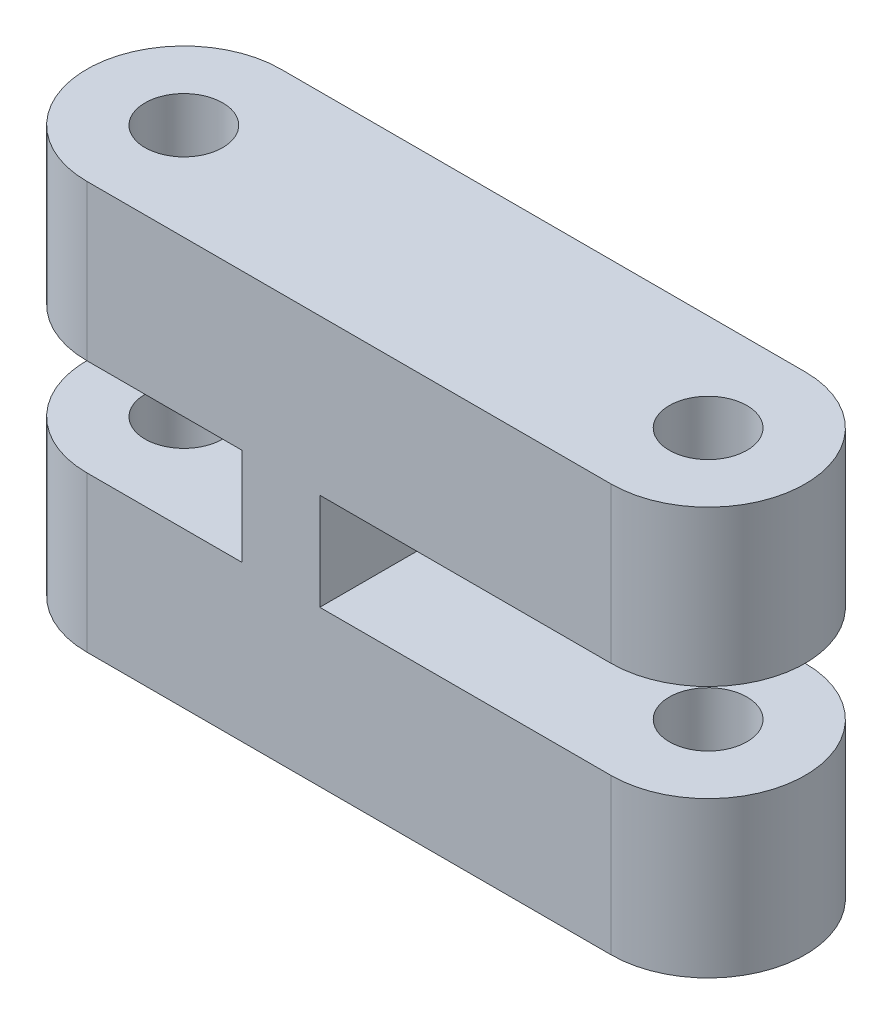
ISO-10303-21;
HEADER;
FILE_DESCRIPTION(('STEP AP214'),'2;1');
FILE_NAME('part.step','',(''),(''),'','','');
FILE_SCHEMA(('AUTOMOTIVE_DESIGN { 1 0 10303 214 1 1 1 1 }'));
ENDSEC;
DATA;
#1=APPLICATION_CONTEXT('core data for automotive mechanical design processes');
#2=APPLICATION_PROTOCOL_DEFINITION('international standard','automotive_design',2000,#1);
#3=PRODUCT_CONTEXT('',#1,'mechanical');
#4=PRODUCT('Part','Part','',(#3));
#5=PRODUCT_RELATED_PRODUCT_CATEGORY('part','',(#4));
#6=PRODUCT_DEFINITION_FORMATION('','',#4);
#7=PRODUCT_DEFINITION_CONTEXT('part definition',#1,'design');
#8=PRODUCT_DEFINITION('design','',#6,#7);
#9=PRODUCT_DEFINITION_SHAPE('','',#8);
#10=(LENGTH_UNIT() NAMED_UNIT(*) SI_UNIT(.MILLI.,.METRE.));
#11=(NAMED_UNIT(*) PLANE_ANGLE_UNIT() SI_UNIT($,.RADIAN.));
#12=(NAMED_UNIT(*) SI_UNIT($,.STERADIAN.) SOLID_ANGLE_UNIT());
#13=UNCERTAINTY_MEASURE_WITH_UNIT(LENGTH_MEASURE(1.E-05),#10,'distance_accuracy_value','');
#14=(GEOMETRIC_REPRESENTATION_CONTEXT(3) GLOBAL_UNCERTAINTY_ASSIGNED_CONTEXT((#13)) GLOBAL_UNIT_ASSIGNED_CONTEXT((#10,
#11,#12)) REPRESENTATION_CONTEXT('',''));
#15=CARTESIAN_POINT('',(0.,0.,0.));
#16=DIRECTION('',(0.,0.,1.));
#17=DIRECTION('',(1.,0.,0.));
#18=AXIS2_PLACEMENT_3D('',#15,#16,#17);
#19=CARTESIAN_POINT('',(-8.87448138205192,21.,32.1786968159599));
#20=DIRECTION('',(0.,0.,-1.));
#21=DIRECTION('',(-1.,0.,0.));
#22=AXIS2_PLACEMENT_3D('',#19,#20,#21);
#23=PLANE('',#22);
#24=DIRECTION('',(0.,-1.,0.));
#25=VECTOR('',#24,1.);
#26=CARTESIAN_POINT('',(-8.87448138205192,21.,32.1786968159599));
#27=LINE('',#26,#25);
#28=CARTESIAN_POINT('',(-8.87448138205192,8.,32.1786968159599));
#29=VERTEX_POINT('',#28);
#30=CARTESIAN_POINT('',(-8.87448138205192,0.,32.1786968159599));
#31=VERTEX_POINT('',#30);
#32=EDGE_CURVE('E22',#29,#31,#27,.T.);
#33=ORIENTED_EDGE('',*,*,#32,.F.);
#34=DIRECTION('',(1.,0.,0.));
#35=VECTOR('',#34,1.);
#36=CARTESIAN_POINT('',(-8.87448138205192,8.,32.1786968159599));
#37=LINE('',#36,#35);
#38=CARTESIAN_POINT('',(-0.874481382051926,8.,32.1786968159599));
#39=VERTEX_POINT('',#38);
#40=EDGE_CURVE('E141',#29,#39,#37,.T.);
#41=ORIENTED_EDGE('',*,*,#40,.T.);
#42=DIRECTION('',(0.,1.,0.));
#43=VECTOR('',#42,1.);
#44=CARTESIAN_POINT('',(-0.874481382051928,21.,32.1786968159599));
#45=LINE('',#44,#43);
#46=CARTESIAN_POINT('',(-0.874481382051926,13.,32.1786968159599));
#47=VERTEX_POINT('',#46);
#48=EDGE_CURVE('E144',#39,#47,#45,.T.);
#49=ORIENTED_EDGE('',*,*,#48,.T.);
#50=DIRECTION('',(-1.,0.,0.));
#51=VECTOR('',#50,1.);
#52=CARTESIAN_POINT('',(-8.87448138205192,13.,32.1786968159599));
#53=LINE('',#52,#51);
#54=CARTESIAN_POINT('',(-8.87448138205192,13.,32.1786968159599));
#55=VERTEX_POINT('',#54);
#56=EDGE_CURVE('E110',#47,#55,#53,.T.);
#57=ORIENTED_EDGE('',*,*,#56,.T.);
#58=CARTESIAN_POINT('',(-8.87448138205192,21.,32.1786968159599));
#59=VERTEX_POINT('',#58);
#60=EDGE_CURVE('E9',#59,#55,#27,.T.);
#61=ORIENTED_EDGE('',*,*,#60,.F.);
#62=DIRECTION('',(1.,0.,0.));
#63=VECTOR('',#62,1.);
#64=CARTESIAN_POINT('',(-8.87448138205192,21.,32.1786968159599));
#65=LINE('',#64,#63);
#66=CARTESIAN_POINT('',(18.1255186179481,21.,32.1786968159599));
#67=VERTEX_POINT('',#66);
#68=EDGE_CURVE('E193',#59,#67,#65,.T.);
#69=ORIENTED_EDGE('',*,*,#68,.T.);
#70=DIRECTION('',(0.,-1.,0.));
#71=VECTOR('',#70,1.);
#72=CARTESIAN_POINT('',(18.1255186179481,21.,32.1786968159599));
#73=LINE('',#72,#71);
#74=CARTESIAN_POINT('',(18.1255186179481,13.,32.1786968159599));
#75=VERTEX_POINT('',#74);
#76=EDGE_CURVE('E223',#67,#75,#73,.T.);
#77=ORIENTED_EDGE('',*,*,#76,.T.);
#78=DIRECTION('',(1.,0.,0.));
#79=VECTOR('',#78,1.);
#80=CARTESIAN_POINT('',(-8.87448138205192,13.,32.1786968159599));
#81=LINE('',#80,#79);
#82=CARTESIAN_POINT('',(3.12551861794808,13.,32.1786968159599));
#83=VERTEX_POINT('',#82);
#84=EDGE_CURVE('E168',#83,#75,#81,.T.);
#85=ORIENTED_EDGE('',*,*,#84,.F.);
#86=DIRECTION('',(0.,1.,0.));
#87=VECTOR('',#86,1.);
#88=CARTESIAN_POINT('',(3.12551861794808,21.,32.1786968159599));
#89=LINE('',#88,#87);
#90=CARTESIAN_POINT('',(3.12551861794808,8.,32.1786968159599));
#91=VERTEX_POINT('',#90);
#92=EDGE_CURVE('E174',#91,#83,#89,.T.);
#93=ORIENTED_EDGE('',*,*,#92,.F.);
#94=DIRECTION('',(-1.,0.,0.));
#95=VECTOR('',#94,1.);
#96=CARTESIAN_POINT('',(-8.87448138205192,8.,32.1786968159599));
#97=LINE('',#96,#95);
#98=CARTESIAN_POINT('',(18.1255186179481,8.,32.1786968159599));
#99=VERTEX_POINT('',#98);
#100=EDGE_CURVE('E172',#99,#91,#97,.T.);
#101=ORIENTED_EDGE('',*,*,#100,.F.);
#102=CARTESIAN_POINT('',(18.1255186179481,0.,32.1786968159599));
#103=VERTEX_POINT('',#102);
#104=EDGE_CURVE('E222',#99,#103,#73,.T.);
#105=ORIENTED_EDGE('',*,*,#104,.T.);
#106=DIRECTION('',(1.,0.,0.));
#107=VECTOR('',#106,1.);
#108=CARTESIAN_POINT('',(-8.87448138205192,0.,32.1786968159599));
#109=LINE('',#108,#107);
#110=EDGE_CURVE('E192',#31,#103,#109,.T.);
#111=ORIENTED_EDGE('',*,*,#110,.F.);
#112=EDGE_LOOP('',(#33,#41,#49,#57,#61,#69,#77,#85,#93,#101,#105,#111));
#113=FACE_BOUND('',#112,.T.);
#114=ADVANCED_FACE('F15',(#113),#23,.T.);
#115=CARTESIAN_POINT('',(18.1255186179481,21.,42.1786968159599));
#116=DIRECTION('',(0.,0.,1.));
#117=DIRECTION('',(1.,0.,0.));
#118=AXIS2_PLACEMENT_3D('',#115,#116,#117);
#119=PLANE('',#118);
#120=DIRECTION('',(0.,-1.,0.));
#121=VECTOR('',#120,1.);
#122=CARTESIAN_POINT('',(-0.874481382051926,13.,42.1786968159599));
#123=LINE('',#122,#121);
#124=CARTESIAN_POINT('',(-0.874481382051926,13.,42.1786968159599));
#125=VERTEX_POINT('',#124);
#126=CARTESIAN_POINT('',(-0.874481382051926,8.,42.1786968159599));
#127=VERTEX_POINT('',#126);
#128=EDGE_CURVE('E116',#125,#127,#123,.T.);
#129=ORIENTED_EDGE('',*,*,#128,.T.);
#130=DIRECTION('',(-1.,0.,0.));
#131=VECTOR('',#130,1.);
#132=CARTESIAN_POINT('',(-0.874481382051926,8.,42.1786968159599));
#133=LINE('',#132,#131);
#134=CARTESIAN_POINT('',(-8.87448138205193,8.,42.1786968159599));
#135=VERTEX_POINT('',#134);
#136=EDGE_CURVE('E126',#127,#135,#133,.T.);
#137=ORIENTED_EDGE('',*,*,#136,.T.);
#138=DIRECTION('',(0.,-1.,0.));
#139=VECTOR('',#138,1.);
#140=CARTESIAN_POINT('',(-8.87448138205192,21.,42.1786968159599));
#141=LINE('',#140,#139);
#142=CARTESIAN_POINT('',(-8.87448138205192,0.,42.1786968159599));
#143=VERTEX_POINT('',#142);
#144=EDGE_CURVE('E203',#135,#143,#141,.T.);
#145=ORIENTED_EDGE('',*,*,#144,.T.);
#146=DIRECTION('',(-1.,0.,0.));
#147=VECTOR('',#146,1.);
#148=CARTESIAN_POINT('',(18.1255186179481,0.,42.1786968159599));
#149=LINE('',#148,#147);
#150=CARTESIAN_POINT('',(18.1255186179481,0.,42.1786968159599));
#151=VERTEX_POINT('',#150);
#152=EDGE_CURVE('E211',#151,#143,#149,.T.);
#153=ORIENTED_EDGE('',*,*,#152,.F.);
#154=DIRECTION('',(0.,-1.,0.));
#155=VECTOR('',#154,1.);
#156=CARTESIAN_POINT('',(18.1255186179481,21.,42.1786968159599));
#157=LINE('',#156,#155);
#158=CARTESIAN_POINT('',(18.1255186179481,8.,42.1786968159599));
#159=VERTEX_POINT('',#158);
#160=EDGE_CURVE('E219',#159,#151,#157,.T.);
#161=ORIENTED_EDGE('',*,*,#160,.F.);
#162=DIRECTION('',(1.,0.,0.));
#163=VECTOR('',#162,1.);
#164=CARTESIAN_POINT('',(3.12551861794808,8.,42.1786968159599));
#165=LINE('',#164,#163);
#166=CARTESIAN_POINT('',(3.12551861794808,8.,42.1786968159599));
#167=VERTEX_POINT('',#166);
#168=EDGE_CURVE('E146',#167,#159,#165,.T.);
#169=ORIENTED_EDGE('',*,*,#168,.F.);
#170=DIRECTION('',(0.,-1.,0.));
#171=VECTOR('',#170,1.);
#172=CARTESIAN_POINT('',(3.12551861794808,13.,42.1786968159599));
#173=LINE('',#172,#171);
#174=CARTESIAN_POINT('',(3.12551861794808,13.,42.1786968159599));
#175=VERTEX_POINT('',#174);
#176=EDGE_CURVE('E155',#175,#167,#173,.T.);
#177=ORIENTED_EDGE('',*,*,#176,.F.);
#178=DIRECTION('',(-1.,0.,0.));
#179=VECTOR('',#178,1.);
#180=CARTESIAN_POINT('',(23.1255186179481,13.,42.1786968159599));
#181=LINE('',#180,#179);
#182=CARTESIAN_POINT('',(18.1255186179481,13.,42.1786968159599));
#183=VERTEX_POINT('',#182);
#184=EDGE_CURVE('E151',#183,#175,#181,.T.);
#185=ORIENTED_EDGE('',*,*,#184,.F.);
#186=CARTESIAN_POINT('',(18.1255186179481,21.,42.1786968159599));
#187=VERTEX_POINT('',#186);
#188=EDGE_CURVE('E220',#187,#183,#157,.T.);
#189=ORIENTED_EDGE('',*,*,#188,.F.);
#190=DIRECTION('',(-1.,0.,0.));
#191=VECTOR('',#190,1.);
#192=CARTESIAN_POINT('',(18.1255186179481,21.,42.1786968159599));
#193=LINE('',#192,#191);
#194=CARTESIAN_POINT('',(-8.87448138205192,21.,42.1786968159599));
#195=VERTEX_POINT('',#194);
#196=EDGE_CURVE('E199',#187,#195,#193,.T.);
#197=ORIENTED_EDGE('',*,*,#196,.T.);
#198=CARTESIAN_POINT('',(-8.87448138205193,13.,42.1786968159599));
#199=VERTEX_POINT('',#198);
#200=EDGE_CURVE('E124',#195,#199,#141,.T.);
#201=ORIENTED_EDGE('',*,*,#200,.T.);
#202=DIRECTION('',(1.,0.,0.));
#203=VECTOR('',#202,1.);
#204=CARTESIAN_POINT('',(-13.8744813820519,13.,42.1786968159599));
#205=LINE('',#204,#203);
#206=EDGE_CURVE('E107',#199,#125,#205,.T.);
#207=ORIENTED_EDGE('',*,*,#206,.T.);
#208=EDGE_LOOP('',(#129,#137,#145,#153,#161,#169,#177,#185,#189,#197,#201,#207));
#209=FACE_BOUND('',#208,.T.);
#210=ADVANCED_FACE('F122',(#209),#119,.T.);
#211=CARTESIAN_POINT('',(-8.87448138205193,21.,37.1786968159599));
#212=DIRECTION('',(0.,-1.,0.));
#213=DIRECTION('',(0.,0.,-1.));
#214=AXIS2_PLACEMENT_3D('',#211,#212,#213);
#215=CYLINDRICAL_SURFACE('',#214,5.);
#216=ORIENTED_EDGE('',*,*,#144,.F.);
#217=CARTESIAN_POINT('',(-8.87448138205193,8.,37.1786968159599));
#218=DIRECTION('',(0.,1.,0.));
#219=DIRECTION('',(0.,0.,1.));
#220=AXIS2_PLACEMENT_3D('',#217,#218,#219);
#221=CIRCLE('',#220,5.);
#222=EDGE_CURVE('E138',#135,#29,#221,.F.);
#223=ORIENTED_EDGE('',*,*,#222,.T.);
#224=ORIENTED_EDGE('',*,*,#32,.T.);
#225=CARTESIAN_POINT('',(-8.87448138205193,0.,37.1786968159599));
#226=DIRECTION('',(0.,-1.,0.));
#227=DIRECTION('',(1.,0.,0.));
#228=AXIS2_PLACEMENT_3D('',#225,#226,#227);
#229=CIRCLE('',#228,5.);
#230=EDGE_CURVE('E197',#143,#31,#229,.T.);
#231=ORIENTED_EDGE('',*,*,#230,.F.);
#232=EDGE_LOOP('',(#216,#223,#224,#231));
#233=FACE_BOUND('',#232,.T.);
#234=ADVANCED_FACE('F241',(#233),#215,.T.);
#235=CARTESIAN_POINT('',(-8.87448138205193,13.,37.1786968159599));
#236=DIRECTION('',(0.,-1.,0.));
#237=DIRECTION('',(1.,0.,0.));
#238=AXIS2_PLACEMENT_3D('',#235,#236,#237);
#239=CIRCLE('',#238,5.);
#240=EDGE_CURVE('E134',#55,#199,#239,.F.);
#241=ORIENTED_EDGE('',*,*,#240,.T.);
#242=ORIENTED_EDGE('',*,*,#200,.F.);
#243=CARTESIAN_POINT('',(-8.87448138205193,21.,37.1786968159599));
#244=DIRECTION('',(0.,-1.,0.));
#245=DIRECTION('',(1.,0.,0.));
#246=AXIS2_PLACEMENT_3D('',#243,#244,#245);
#247=CIRCLE('',#246,5.);
#248=EDGE_CURVE('E201',#195,#59,#247,.T.);
#249=ORIENTED_EDGE('',*,*,#248,.T.);
#250=ORIENTED_EDGE('',*,*,#60,.T.);
#251=EDGE_LOOP('',(#241,#242,#249,#250));
#252=FACE_BOUND('',#251,.T.);
#253=ADVANCED_FACE('F265',(#252),#215,.T.);
#254=CARTESIAN_POINT('',(-8.87448138205193,0.,37.1786968159599));
#255=DIRECTION('',(0.,1.,0.));
#256=DIRECTION('',(0.,0.,-1.));
#257=AXIS2_PLACEMENT_3D('',#254,#255,#256);
#258=CYLINDRICAL_SURFACE('',#257,2.);
#259=CARTESIAN_POINT('',(-8.87448138205193,0.,37.1786968159599));
#260=DIRECTION('',(0.,1.,0.));
#261=DIRECTION('',(0.,0.,-1.));
#262=AXIS2_PLACEMENT_3D('',#259,#260,#261);
#263=CIRCLE('',#262,2.);
#264=CARTESIAN_POINT('',(-8.87448138205193,0.,35.1786968159599));
#265=VERTEX_POINT('',#264);
#266=EDGE_CURVE('E186',#265,#265,#263,.T.);
#267=ORIENTED_EDGE('',*,*,#266,.F.);
#268=EDGE_LOOP('',(#267));
#269=FACE_BOUND('',#268,.T.);
#270=CARTESIAN_POINT('',(-8.87448138205193,8.,37.1786968159599));
#271=DIRECTION('',(0.,1.,0.));
#272=DIRECTION('',(0.,0.,1.));
#273=AXIS2_PLACEMENT_3D('',#270,#271,#272);
#274=CIRCLE('',#273,2.);
#275=CARTESIAN_POINT('',(-8.87448138205193,8.,39.1786968159599));
#276=VERTEX_POINT('',#275);
#277=EDGE_CURVE('E137',#276,#276,#274,.F.);
#278=ORIENTED_EDGE('',*,*,#277,.F.);
#279=EDGE_LOOP('',(#278));
#280=FACE_BOUND('',#279,.T.);
#281=ADVANCED_FACE('F267',(#269,#280),#258,.F.);
#282=CARTESIAN_POINT('',(-8.87448138205193,21.,37.1786968159599));
#283=DIRECTION('',(0.,-1.,0.));
#284=DIRECTION('',(0.,0.,-1.));
#285=AXIS2_PLACEMENT_3D('',#282,#283,#284);
#286=CIRCLE('',#285,2.);
#287=CARTESIAN_POINT('',(-8.87448138205193,21.,35.1786968159599));
#288=VERTEX_POINT('',#287);
#289=EDGE_CURVE('E189',#288,#288,#286,.T.);
#290=ORIENTED_EDGE('',*,*,#289,.F.);
#291=EDGE_LOOP('',(#290));
#292=FACE_BOUND('',#291,.T.);
#293=CARTESIAN_POINT('',(-8.87448138205193,13.,37.1786968159599));
#294=DIRECTION('',(0.,-1.,0.));
#295=DIRECTION('',(1.,0.,0.));
#296=AXIS2_PLACEMENT_3D('',#293,#294,#295);
#297=CIRCLE('',#296,2.);
#298=CARTESIAN_POINT('',(-6.87448138205192,13.,37.1786968159599));
#299=VERTEX_POINT('',#298);
#300=EDGE_CURVE('E113',#299,#299,#297,.F.);
#301=ORIENTED_EDGE('',*,*,#300,.F.);
#302=EDGE_LOOP('',(#301));
#303=FACE_BOUND('',#302,.T.);
#304=ADVANCED_FACE('F274',(#292,#303),#258,.F.);
#305=CARTESIAN_POINT('',(18.1255186179481,21.,37.1786968159599));
#306=DIRECTION('',(0.,-1.,0.));
#307=DIRECTION('',(0.,0.,-1.));
#308=AXIS2_PLACEMENT_3D('',#305,#306,#307);
#309=CYLINDRICAL_SURFACE('',#308,5.);
#310=CARTESIAN_POINT('',(18.1255186179481,8.,37.1786968159599));
#311=DIRECTION('',(0.,-1.,0.));
#312=DIRECTION('',(1.,0.,0.));
#313=AXIS2_PLACEMENT_3D('',#310,#311,#312);
#314=CIRCLE('',#313,5.);
#315=EDGE_CURVE('E37',#159,#99,#314,.F.);
#316=ORIENTED_EDGE('',*,*,#315,.F.);
#317=ORIENTED_EDGE('',*,*,#160,.T.);
#318=CARTESIAN_POINT('',(18.1255186179481,0.,37.1786968159599));
#319=DIRECTION('',(0.,-1.,0.));
#320=DIRECTION('',(-1.,0.,0.));
#321=AXIS2_PLACEMENT_3D('',#318,#319,#320);
#322=CIRCLE('',#321,5.);
#323=EDGE_CURVE('E207',#103,#151,#322,.T.);
#324=ORIENTED_EDGE('',*,*,#323,.F.);
#325=ORIENTED_EDGE('',*,*,#104,.F.);
#326=EDGE_LOOP('',(#316,#317,#324,#325));
#327=FACE_BOUND('',#326,.T.);
#328=ADVANCED_FACE('F233',(#327),#309,.T.);
#329=CARTESIAN_POINT('',(18.1255186179481,0.,37.1786968159599));
#330=DIRECTION('',(0.,1.,0.));
#331=DIRECTION('',(0.,0.,-1.));
#332=AXIS2_PLACEMENT_3D('',#329,#330,#331);
#333=CYLINDRICAL_SURFACE('',#332,2.);
#334=CARTESIAN_POINT('',(18.1255186179481,8.,37.1786968159599));
#335=DIRECTION('',(0.,-1.,0.));
#336=DIRECTION('',(1.,0.,0.));
#337=AXIS2_PLACEMENT_3D('',#334,#335,#336);
#338=CIRCLE('',#337,2.);
#339=CARTESIAN_POINT('',(20.1255186179481,8.,37.1786968159599));
#340=VERTEX_POINT('',#339);
#341=EDGE_CURVE('E170',#340,#340,#338,.F.);
#342=ORIENTED_EDGE('',*,*,#341,.T.);
#343=EDGE_LOOP('',(#342));
#344=FACE_BOUND('',#343,.T.);
#345=CARTESIAN_POINT('',(18.1255186179481,0.,37.1786968159599));
#346=DIRECTION('',(0.,1.,0.));
#347=DIRECTION('',(0.,0.,-1.));
#348=AXIS2_PLACEMENT_3D('',#345,#346,#347);
#349=CIRCLE('',#348,2.);
#350=CARTESIAN_POINT('',(18.1255186179481,0.,35.1786968159599));
#351=VERTEX_POINT('',#350);
#352=EDGE_CURVE('E176',#351,#351,#349,.T.);
#353=ORIENTED_EDGE('',*,*,#352,.F.);
#354=EDGE_LOOP('',(#353));
#355=FACE_BOUND('',#354,.T.);
#356=ADVANCED_FACE('F286',(#344,#355),#333,.F.);
#357=CARTESIAN_POINT('',(18.1255186179481,13.,37.1786968159599));
#358=DIRECTION('',(0.,1.,0.));
#359=DIRECTION('',(0.,0.,1.));
#360=AXIS2_PLACEMENT_3D('',#357,#358,#359);
#361=CIRCLE('',#360,5.);
#362=EDGE_CURVE('E166',#75,#183,#361,.F.);
#363=ORIENTED_EDGE('',*,*,#362,.F.);
#364=ORIENTED_EDGE('',*,*,#76,.F.);
#365=CARTESIAN_POINT('',(18.1255186179481,21.,37.1786968159599));
#366=DIRECTION('',(0.,-1.,0.));
#367=DIRECTION('',(-1.,0.,0.));
#368=AXIS2_PLACEMENT_3D('',#365,#366,#367);
#369=CIRCLE('',#368,5.);
#370=EDGE_CURVE('E196',#67,#187,#369,.T.);
#371=ORIENTED_EDGE('',*,*,#370,.T.);
#372=ORIENTED_EDGE('',*,*,#188,.T.);
#373=EDGE_LOOP('',(#363,#364,#371,#372));
#374=FACE_BOUND('',#373,.T.);
#375=ADVANCED_FACE('F257',(#374),#309,.T.);
#376=CARTESIAN_POINT('',(-8.87448138205192,21.,37.1786968159599));
#377=DIRECTION('',(0.,-1.,0.));
#378=DIRECTION('',(0.,0.,-1.));
#379=AXIS2_PLACEMENT_3D('',#376,#377,#378);
#380=PLANE('',#379);
#381=CARTESIAN_POINT('',(18.1255186179481,21.,37.1786968159599));
#382=DIRECTION('',(0.,-1.,0.));
#383=DIRECTION('',(0.,0.,-1.));
#384=AXIS2_PLACEMENT_3D('',#381,#382,#383);
#385=CIRCLE('',#384,2.);
#386=CARTESIAN_POINT('',(18.1255186179481,21.,35.1786968159599));
#387=VERTEX_POINT('',#386);
#388=EDGE_CURVE('E183',#387,#387,#385,.T.);
#389=ORIENTED_EDGE('',*,*,#388,.T.);
#390=EDGE_LOOP('',(#389));
#391=FACE_BOUND('',#390,.T.);
#392=ORIENTED_EDGE('',*,*,#289,.T.);
#393=EDGE_LOOP('',(#392));
#394=FACE_BOUND('',#393,.T.);
#395=ORIENTED_EDGE('',*,*,#68,.F.);
#396=ORIENTED_EDGE('',*,*,#248,.F.);
#397=ORIENTED_EDGE('',*,*,#196,.F.);
#398=ORIENTED_EDGE('',*,*,#370,.F.);
#399=EDGE_LOOP('',(#395,#396,#397,#398));
#400=FACE_BOUND('',#399,.T.);
#401=ADVANCED_FACE('F261',(#391,#394,#400),#380,.F.);
#402=CARTESIAN_POINT('',(-8.87448138205192,0.,37.1786968159599));
#403=DIRECTION('',(0.,-1.,0.));
#404=DIRECTION('',(0.,0.,-1.));
#405=AXIS2_PLACEMENT_3D('',#402,#403,#404);
#406=PLANE('',#405);
#407=ORIENTED_EDGE('',*,*,#352,.T.);
#408=EDGE_LOOP('',(#407));
#409=FACE_BOUND('',#408,.T.);
#410=ORIENTED_EDGE('',*,*,#266,.T.);
#411=EDGE_LOOP('',(#410));
#412=FACE_BOUND('',#411,.T.);
#413=ORIENTED_EDGE('',*,*,#230,.T.);
#414=ORIENTED_EDGE('',*,*,#110,.T.);
#415=ORIENTED_EDGE('',*,*,#323,.T.);
#416=ORIENTED_EDGE('',*,*,#152,.T.);
#417=EDGE_LOOP('',(#413,#414,#415,#416));
#418=FACE_BOUND('',#417,.T.);
#419=ADVANCED_FACE('F237',(#409,#412,#418),#406,.T.);
#420=CARTESIAN_POINT('',(18.1255186179481,13.,37.1786968159599));
#421=DIRECTION('',(0.,1.,0.));
#422=DIRECTION('',(0.,0.,1.));
#423=AXIS2_PLACEMENT_3D('',#420,#421,#422);
#424=CIRCLE('',#423,2.);
#425=CARTESIAN_POINT('',(18.1255186179481,13.,39.1786968159599));
#426=VERTEX_POINT('',#425);
#427=EDGE_CURVE('E165',#426,#426,#424,.F.);
#428=ORIENTED_EDGE('',*,*,#427,.T.);
#429=EDGE_LOOP('',(#428));
#430=FACE_BOUND('',#429,.T.);
#431=ORIENTED_EDGE('',*,*,#388,.F.);
#432=EDGE_LOOP('',(#431));
#433=FACE_BOUND('',#432,.T.);
#434=ADVANCED_FACE('F295',(#430,#433),#333,.F.);
#435=CARTESIAN_POINT('',(3.12551861794808,13.,-1.52484995086438));
#436=DIRECTION('',(-1.,0.,0.));
#437=DIRECTION('',(0.,-1.,0.));
#438=AXIS2_PLACEMENT_3D('',#435,#436,#437);
#439=PLANE('',#438);
#440=ORIENTED_EDGE('',*,*,#92,.T.);
#441=DIRECTION('',(0.,0.,1.));
#442=VECTOR('',#441,1.);
#443=CARTESIAN_POINT('',(3.12551861794808,13.,-1.52484995086438));
#444=LINE('',#443,#442);
#445=EDGE_CURVE('E163',#83,#175,#444,.T.);
#446=ORIENTED_EDGE('',*,*,#445,.T.);
#447=ORIENTED_EDGE('',*,*,#176,.T.);
#448=DIRECTION('',(0.,0.,1.));
#449=VECTOR('',#448,1.);
#450=CARTESIAN_POINT('',(3.12551861794808,8.,-1.52484995086438));
#451=LINE('',#450,#449);
#452=EDGE_CURVE('E159',#91,#167,#451,.T.);
#453=ORIENTED_EDGE('',*,*,#452,.F.);
#454=EDGE_LOOP('',(#440,#446,#447,#453));
#455=FACE_BOUND('',#454,.T.);
#456=ADVANCED_FACE('F249',(#455),#439,.F.);
#457=CARTESIAN_POINT('',(3.12551861794808,8.,-1.52484995086438));
#458=DIRECTION('',(0.,-1.,0.));
#459=DIRECTION('',(1.,0.,0.));
#460=AXIS2_PLACEMENT_3D('',#457,#458,#459);
#461=PLANE('',#460);
#462=ORIENTED_EDGE('',*,*,#341,.F.);
#463=EDGE_LOOP('',(#462));
#464=FACE_BOUND('',#463,.T.);
#465=ORIENTED_EDGE('',*,*,#100,.T.);
#466=ORIENTED_EDGE('',*,*,#452,.T.);
#467=ORIENTED_EDGE('',*,*,#168,.T.);
#468=ORIENTED_EDGE('',*,*,#315,.T.);
#469=EDGE_LOOP('',(#465,#466,#467,#468));
#470=FACE_BOUND('',#469,.T.);
#471=ADVANCED_FACE('F246',(#464,#470),#461,.F.);
#472=CARTESIAN_POINT('',(23.1255186179481,13.,-1.52484995086438));
#473=DIRECTION('',(0.,1.,0.));
#474=DIRECTION('',(0.,0.,1.));
#475=AXIS2_PLACEMENT_3D('',#472,#473,#474);
#476=PLANE('',#475);
#477=ORIENTED_EDGE('',*,*,#427,.F.);
#478=EDGE_LOOP('',(#477));
#479=FACE_BOUND('',#478,.T.);
#480=ORIENTED_EDGE('',*,*,#84,.T.);
#481=ORIENTED_EDGE('',*,*,#362,.T.);
#482=ORIENTED_EDGE('',*,*,#184,.T.);
#483=ORIENTED_EDGE('',*,*,#445,.F.);
#484=EDGE_LOOP('',(#480,#481,#482,#483));
#485=FACE_BOUND('',#484,.T.);
#486=ADVANCED_FACE('F252',(#479,#485),#476,.F.);
#487=CARTESIAN_POINT('',(-0.874481382051926,13.,-1.52484995086438));
#488=DIRECTION('',(-1.,0.,0.));
#489=DIRECTION('',(0.,-1.,0.));
#490=AXIS2_PLACEMENT_3D('',#487,#488,#489);
#491=PLANE('',#490);
#492=DIRECTION('',(0.,0.,1.));
#493=VECTOR('',#492,1.);
#494=CARTESIAN_POINT('',(-0.874481382051926,8.,-1.52484995086438));
#495=LINE('',#494,#493);
#496=EDGE_CURVE('E29',#39,#127,#495,.T.);
#497=ORIENTED_EDGE('',*,*,#496,.T.);
#498=ORIENTED_EDGE('',*,*,#128,.F.);
#499=DIRECTION('',(0.,0.,1.));
#500=VECTOR('',#499,1.);
#501=CARTESIAN_POINT('',(-0.874481382051926,13.,-1.52484995086438));
#502=LINE('',#501,#500);
#503=EDGE_CURVE('E103',#47,#125,#502,.T.);
#504=ORIENTED_EDGE('',*,*,#503,.F.);
#505=ORIENTED_EDGE('',*,*,#48,.F.);
#506=EDGE_LOOP('',(#497,#498,#504,#505));
#507=FACE_BOUND('',#506,.T.);
#508=ADVANCED_FACE('F117',(#507),#491,.T.);
#509=CARTESIAN_POINT('',(-0.874481382051926,8.,-1.52484995086438));
#510=DIRECTION('',(0.,1.,0.));
#511=DIRECTION('',(0.,0.,1.));
#512=AXIS2_PLACEMENT_3D('',#509,#510,#511);
#513=PLANE('',#512);
#514=ORIENTED_EDGE('',*,*,#277,.T.);
#515=EDGE_LOOP('',(#514));
#516=FACE_BOUND('',#515,.T.);
#517=ORIENTED_EDGE('',*,*,#222,.F.);
#518=ORIENTED_EDGE('',*,*,#136,.F.);
#519=ORIENTED_EDGE('',*,*,#496,.F.);
#520=ORIENTED_EDGE('',*,*,#40,.F.);
#521=EDGE_LOOP('',(#517,#518,#519,#520));
#522=FACE_BOUND('',#521,.T.);
#523=ADVANCED_FACE('F242',(#516,#522),#513,.T.);
#524=CARTESIAN_POINT('',(-13.8744813820519,13.,-1.52484995086438));
#525=DIRECTION('',(0.,-1.,0.));
#526=DIRECTION('',(1.,0.,0.));
#527=AXIS2_PLACEMENT_3D('',#524,#525,#526);
#528=PLANE('',#527);
#529=ORIENTED_EDGE('',*,*,#300,.T.);
#530=EDGE_LOOP('',(#529));
#531=FACE_BOUND('',#530,.T.);
#532=ORIENTED_EDGE('',*,*,#503,.T.);
#533=ORIENTED_EDGE('',*,*,#206,.F.);
#534=ORIENTED_EDGE('',*,*,#240,.F.);
#535=ORIENTED_EDGE('',*,*,#56,.F.);
#536=EDGE_LOOP('',(#532,#533,#534,#535));
#537=FACE_BOUND('',#536,.T.);
#538=ADVANCED_FACE('F105',(#531,#537),#528,.T.);
#539=CLOSED_SHELL('',(#114,#210,#234,#253,#281,#304,#328,#356,#375,#401,#419,#434,#456,#471,
#486,#508,#523,#538));
#540=MANIFOLD_SOLID_BREP('B1',#539);
#541=ADVANCED_BREP_SHAPE_REPRESENTATION('',(#18,#540),#14);
#542=SHAPE_DEFINITION_REPRESENTATION(#9,#541);
ENDSEC;
END-ISO-10303-21;
